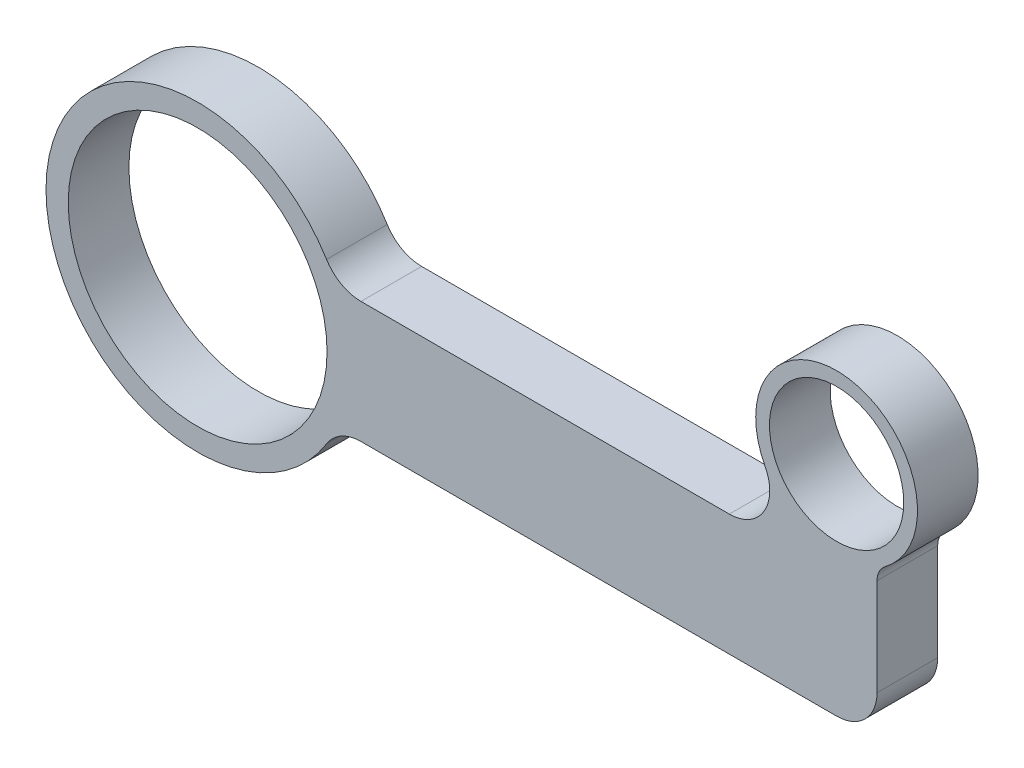
ISO-10303-21;
HEADER;
FILE_DESCRIPTION(('STEP AP214'),'2;1');
FILE_NAME('part.step','',(''),(''),'','','');
FILE_SCHEMA(('AUTOMOTIVE_DESIGN { 1 0 10303 214 1 1 1 1 }'));
ENDSEC;
DATA;
#1=APPLICATION_CONTEXT('core data for automotive mechanical design processes');
#2=APPLICATION_PROTOCOL_DEFINITION('international standard','automotive_design',2000,#1);
#3=PRODUCT_CONTEXT('',#1,'mechanical');
#4=PRODUCT('Part','Part','',(#3));
#5=PRODUCT_RELATED_PRODUCT_CATEGORY('part','',(#4));
#6=PRODUCT_DEFINITION_FORMATION('','',#4);
#7=PRODUCT_DEFINITION_CONTEXT('part definition',#1,'design');
#8=PRODUCT_DEFINITION('design','',#6,#7);
#9=PRODUCT_DEFINITION_SHAPE('','',#8);
#10=(LENGTH_UNIT() NAMED_UNIT(*) SI_UNIT(.MILLI.,.METRE.));
#11=(NAMED_UNIT(*) PLANE_ANGLE_UNIT() SI_UNIT($,.RADIAN.));
#12=(NAMED_UNIT(*) SI_UNIT($,.STERADIAN.) SOLID_ANGLE_UNIT());
#13=UNCERTAINTY_MEASURE_WITH_UNIT(LENGTH_MEASURE(1.E-05),#10,'distance_accuracy_value','');
#14=(GEOMETRIC_REPRESENTATION_CONTEXT(3) GLOBAL_UNCERTAINTY_ASSIGNED_CONTEXT((#13)) GLOBAL_UNIT_ASSIGNED_CONTEXT((#10,
#11,#12)) REPRESENTATION_CONTEXT('',''));
#15=CARTESIAN_POINT('',(0.,0.,0.));
#16=DIRECTION('',(0.,0.,1.));
#17=DIRECTION('',(1.,0.,0.));
#18=AXIS2_PLACEMENT_3D('',#15,#16,#17);
#19=CARTESIAN_POINT('',(119.38,24.13,19.05));
#20=DIRECTION('',(0.,0.,-1.));
#21=DIRECTION('',(-1.,0.,0.));
#22=AXIS2_PLACEMENT_3D('',#19,#20,#21);
#23=PLANE('',#22);
#24=CARTESIAN_POINT('',(119.38,24.13,19.05));
#25=DIRECTION('',(0.,0.,-1.));
#26=DIRECTION('',(-1.,0.,0.));
#27=AXIS2_PLACEMENT_3D('',#24,#25,#26);
#28=CIRCLE('',#27,6.35);
#29=CARTESIAN_POINT('',(113.03,24.13,19.05));
#30=VERTEX_POINT('',#29);
#31=CARTESIAN_POINT('',(115.57,29.21,19.05));
#32=VERTEX_POINT('',#31);
#33=EDGE_CURVE('E162',#30,#32,#28,.T.);
#34=ORIENTED_EDGE('',*,*,#33,.T.);
#35=CARTESIAN_POINT('',(100.33,49.53,19.05));
#36=DIRECTION('',(0.,0.,1.));
#37=DIRECTION('',(1.,0.,0.));
#38=AXIS2_PLACEMENT_3D('',#35,#36,#37);
#39=CIRCLE('',#38,25.4);
#40=CARTESIAN_POINT('',(77.8653947533261,37.6766666666666,19.05));
#41=VERTEX_POINT('',#40);
#42=EDGE_CURVE('E98',#32,#41,#39,.T.);
#43=ORIENTED_EDGE('',*,*,#42,.T.);
#44=CARTESIAN_POINT('',(66.6330921299892,31.75,19.05));
#45=DIRECTION('',(0.,0.,-1.));
#46=DIRECTION('',(1.,0.,0.));
#47=AXIS2_PLACEMENT_3D('',#44,#45,#46);
#48=CIRCLE('',#47,12.7);
#49=CARTESIAN_POINT('',(66.6330921299892,19.05,19.05));
#50=VERTEX_POINT('',#49);
#51=EDGE_CURVE('E183',#41,#50,#48,.T.);
#52=ORIENTED_EDGE('',*,*,#51,.T.);
#53=DIRECTION('',(-1.,0.,0.));
#54=VECTOR('',#53,1.);
#55=CARTESIAN_POINT('',(66.6330921299892,19.05,19.05));
#56=LINE('',#55,#54);
#57=CARTESIAN_POINT('',(-49.0363052120438,19.05,19.05));
#58=VERTEX_POINT('',#57);
#59=EDGE_CURVE('E200',#50,#58,#56,.T.);
#60=ORIENTED_EDGE('',*,*,#59,.T.);
#61=CARTESIAN_POINT('',(-49.0363052120438,31.75,19.05));
#62=DIRECTION('',(0.,0.,-1.));
#63=DIRECTION('',(1.,0.,0.));
#64=AXIS2_PLACEMENT_3D('',#61,#62,#63);
#65=CIRCLE('',#64,12.7);
#66=CARTESIAN_POINT('',(-59.834977798982,25.0657894736842,19.05));
#67=VERTEX_POINT('',#66);
#68=EDGE_CURVE('E197',#58,#67,#65,.T.);
#69=ORIENTED_EDGE('',*,*,#68,.T.);
#70=CARTESIAN_POINT('',(-100.33,0.,19.05));
#71=DIRECTION('',(0.,0.,1.));
#72=DIRECTION('',(1.,0.,0.));
#73=AXIS2_PLACEMENT_3D('',#70,#71,#72);
#74=CIRCLE('',#73,47.625);
#75=CARTESIAN_POINT('',(-59.834977798982,-25.0657894736842,19.05));
#76=VERTEX_POINT('',#75);
#77=EDGE_CURVE('E199',#67,#76,#74,.T.);
#78=ORIENTED_EDGE('',*,*,#77,.T.);
#79=CARTESIAN_POINT('',(-49.0363052120438,-31.75,19.05));
#80=DIRECTION('',(0.,0.,-1.));
#81=DIRECTION('',(-1.,0.,0.));
#82=AXIS2_PLACEMENT_3D('',#79,#80,#81);
#83=CIRCLE('',#82,12.7);
#84=CARTESIAN_POINT('',(-49.0363052120438,-19.05,19.05));
#85=VERTEX_POINT('',#84);
#86=EDGE_CURVE('E123',#76,#85,#83,.T.);
#87=ORIENTED_EDGE('',*,*,#86,.T.);
#88=DIRECTION('',(1.,0.,0.));
#89=VECTOR('',#88,1.);
#90=CARTESIAN_POINT('',(-49.0363052120438,-19.05,19.05));
#91=LINE('',#90,#89);
#92=CARTESIAN_POINT('',(100.33,-19.05,19.05));
#93=VERTEX_POINT('',#92);
#94=EDGE_CURVE('E117',#85,#93,#91,.T.);
#95=ORIENTED_EDGE('',*,*,#94,.T.);
#96=CARTESIAN_POINT('',(100.33,-6.35,19.05));
#97=DIRECTION('',(0.,0.,1.));
#98=DIRECTION('',(1.,0.,0.));
#99=AXIS2_PLACEMENT_3D('',#96,#97,#98);
#100=CIRCLE('',#99,12.7);
#101=CARTESIAN_POINT('',(113.03,-6.35,19.05));
#102=VERTEX_POINT('',#101);
#103=EDGE_CURVE('E121',#93,#102,#100,.T.);
#104=ORIENTED_EDGE('',*,*,#103,.T.);
#105=DIRECTION('',(0.,1.,0.));
#106=VECTOR('',#105,1.);
#107=CARTESIAN_POINT('',(113.03,-6.35,19.05));
#108=LINE('',#107,#106);
#109=EDGE_CURVE('E49',#102,#30,#108,.T.);
#110=ORIENTED_EDGE('',*,*,#109,.T.);
#111=EDGE_LOOP('',(#34,#43,#52,#60,#69,#78,#87,#95,#104,#110));
#112=FACE_BOUND('',#111,.T.);
#113=CARTESIAN_POINT('',(-100.33,0.,19.05));
#114=DIRECTION('',(0.,0.,1.));
#115=DIRECTION('',(1.,0.,0.));
#116=AXIS2_PLACEMENT_3D('',#113,#114,#115);
#117=CIRCLE('',#116,40.64);
#118=CARTESIAN_POINT('',(-59.69,0.,19.05));
#119=VERTEX_POINT('',#118);
#120=EDGE_CURVE('E144',#119,#119,#117,.T.);
#121=ORIENTED_EDGE('',*,*,#120,.F.);
#122=EDGE_LOOP('',(#121));
#123=FACE_BOUND('',#122,.T.);
#124=CARTESIAN_POINT('',(100.33,49.53,19.05));
#125=DIRECTION('',(0.,0.,1.));
#126=DIRECTION('',(1.,0.,0.));
#127=AXIS2_PLACEMENT_3D('',#124,#125,#126);
#128=CIRCLE('',#127,21.0820000000001);
#129=CARTESIAN_POINT('',(121.412,49.53,19.05));
#130=VERTEX_POINT('',#129);
#131=EDGE_CURVE('E211',#130,#130,#128,.T.);
#132=ORIENTED_EDGE('',*,*,#131,.F.);
#133=EDGE_LOOP('',(#132));
#134=FACE_BOUND('',#133,.T.);
#135=ADVANCED_FACE('F32',(#112,#123,#134),#23,.F.);
#136=CARTESIAN_POINT('',(119.38,24.13,0.));
#137=DIRECTION('',(0.,0.,-1.));
#138=DIRECTION('',(-1.,0.,0.));
#139=AXIS2_PLACEMENT_3D('',#136,#137,#138);
#140=PLANE('',#139);
#141=CARTESIAN_POINT('',(-100.33,0.,0.));
#142=DIRECTION('',(0.,0.,1.));
#143=DIRECTION('',(1.,0.,0.));
#144=AXIS2_PLACEMENT_3D('',#141,#142,#143);
#145=CIRCLE('',#144,40.64);
#146=CARTESIAN_POINT('',(-59.69,0.,0.));
#147=VERTEX_POINT('',#146);
#148=EDGE_CURVE('E208',#147,#147,#145,.T.);
#149=ORIENTED_EDGE('',*,*,#148,.T.);
#150=EDGE_LOOP('',(#149));
#151=FACE_BOUND('',#150,.T.);
#152=CARTESIAN_POINT('',(119.38,24.13,0.));
#153=DIRECTION('',(0.,0.,-1.));
#154=DIRECTION('',(-1.,0.,0.));
#155=AXIS2_PLACEMENT_3D('',#152,#153,#154);
#156=CIRCLE('',#155,6.35);
#157=CARTESIAN_POINT('',(113.03,24.13,0.));
#158=VERTEX_POINT('',#157);
#159=CARTESIAN_POINT('',(115.57,29.21,0.));
#160=VERTEX_POINT('',#159);
#161=EDGE_CURVE('E140',#158,#160,#156,.T.);
#162=ORIENTED_EDGE('',*,*,#161,.F.);
#163=DIRECTION('',(0.,1.,0.));
#164=VECTOR('',#163,1.);
#165=CARTESIAN_POINT('',(113.03,-6.35,0.));
#166=LINE('',#165,#164);
#167=CARTESIAN_POINT('',(113.03,-6.35,0.));
#168=VERTEX_POINT('',#167);
#169=EDGE_CURVE('E90',#168,#158,#166,.T.);
#170=ORIENTED_EDGE('',*,*,#169,.F.);
#171=CARTESIAN_POINT('',(100.33,-6.35,0.));
#172=DIRECTION('',(0.,0.,1.));
#173=DIRECTION('',(1.,0.,0.));
#174=AXIS2_PLACEMENT_3D('',#171,#172,#173);
#175=CIRCLE('',#174,12.7);
#176=CARTESIAN_POINT('',(100.33,-19.05,0.));
#177=VERTEX_POINT('',#176);
#178=EDGE_CURVE('E84',#177,#168,#175,.T.);
#179=ORIENTED_EDGE('',*,*,#178,.F.);
#180=DIRECTION('',(1.,0.,0.));
#181=VECTOR('',#180,1.);
#182=CARTESIAN_POINT('',(12.7,-19.05,0.));
#183=LINE('',#182,#181);
#184=CARTESIAN_POINT('',(-49.0363052120438,-19.05,0.));
#185=VERTEX_POINT('',#184);
#186=EDGE_CURVE('E130',#185,#177,#183,.T.);
#187=ORIENTED_EDGE('',*,*,#186,.F.);
#188=CARTESIAN_POINT('',(-49.0363052120438,-31.75,0.));
#189=DIRECTION('',(0.,0.,-1.));
#190=DIRECTION('',(-1.,0.,0.));
#191=AXIS2_PLACEMENT_3D('',#188,#189,#190);
#192=CIRCLE('',#191,12.7);
#193=CARTESIAN_POINT('',(-59.834977798982,-25.0657894736842,0.));
#194=VERTEX_POINT('',#193);
#195=EDGE_CURVE('E156',#194,#185,#192,.T.);
#196=ORIENTED_EDGE('',*,*,#195,.F.);
#197=CARTESIAN_POINT('',(-100.33,0.,0.));
#198=DIRECTION('',(0.,0.,1.));
#199=DIRECTION('',(1.,0.,0.));
#200=AXIS2_PLACEMENT_3D('',#197,#198,#199);
#201=CIRCLE('',#200,47.625);
#202=CARTESIAN_POINT('',(-59.834977798982,25.0657894736842,0.));
#203=VERTEX_POINT('',#202);
#204=EDGE_CURVE('E154',#203,#194,#201,.T.);
#205=ORIENTED_EDGE('',*,*,#204,.F.);
#206=CARTESIAN_POINT('',(-49.0363052120438,31.75,0.));
#207=DIRECTION('',(0.,0.,-1.));
#208=DIRECTION('',(1.,0.,0.));
#209=AXIS2_PLACEMENT_3D('',#206,#207,#208);
#210=CIRCLE('',#209,12.7);
#211=CARTESIAN_POINT('',(-49.0363052120438,19.05,0.));
#212=VERTEX_POINT('',#211);
#213=EDGE_CURVE('E151',#212,#203,#210,.T.);
#214=ORIENTED_EDGE('',*,*,#213,.F.);
#215=DIRECTION('',(-1.,0.,0.));
#216=VECTOR('',#215,1.);
#217=CARTESIAN_POINT('',(-49.0363052120438,19.05,0.));
#218=LINE('',#217,#216);
#219=CARTESIAN_POINT('',(66.6330921299892,19.05,0.));
#220=VERTEX_POINT('',#219);
#221=EDGE_CURVE('E149',#220,#212,#218,.T.);
#222=ORIENTED_EDGE('',*,*,#221,.F.);
#223=CARTESIAN_POINT('',(66.6330921299892,31.75,0.));
#224=DIRECTION('',(0.,0.,-1.));
#225=DIRECTION('',(1.,0.,0.));
#226=AXIS2_PLACEMENT_3D('',#223,#224,#225);
#227=CIRCLE('',#226,12.7);
#228=CARTESIAN_POINT('',(77.8653947533261,37.6766666666666,0.));
#229=VERTEX_POINT('',#228);
#230=EDGE_CURVE('E146',#229,#220,#227,.T.);
#231=ORIENTED_EDGE('',*,*,#230,.F.);
#232=CARTESIAN_POINT('',(100.33,49.53,0.));
#233=DIRECTION('',(0.,0.,1.));
#234=DIRECTION('',(1.,0.,0.));
#235=AXIS2_PLACEMENT_3D('',#232,#233,#234);
#236=CIRCLE('',#235,25.4);
#237=EDGE_CURVE('E143',#160,#229,#236,.T.);
#238=ORIENTED_EDGE('',*,*,#237,.F.);
#239=EDGE_LOOP('',(#162,#170,#179,#187,#196,#205,#214,#222,#231,#238));
#240=FACE_BOUND('',#239,.T.);
#241=CARTESIAN_POINT('',(100.33,49.53,0.));
#242=DIRECTION('',(0.,0.,1.));
#243=DIRECTION('',(1.,0.,0.));
#244=AXIS2_PLACEMENT_3D('',#241,#242,#243);
#245=CIRCLE('',#244,21.0820000000001);
#246=CARTESIAN_POINT('',(121.412,49.53,0.));
#247=VERTEX_POINT('',#246);
#248=EDGE_CURVE('E214',#247,#247,#245,.T.);
#249=ORIENTED_EDGE('',*,*,#248,.T.);
#250=EDGE_LOOP('',(#249));
#251=FACE_BOUND('',#250,.T.);
#252=ADVANCED_FACE('F186',(#151,#240,#251),#140,.T.);
#253=CARTESIAN_POINT('',(119.38,24.13,19.05));
#254=DIRECTION('',(0.,0.,-1.));
#255=DIRECTION('',(-1.,0.,0.));
#256=AXIS2_PLACEMENT_3D('',#253,#254,#255);
#257=CYLINDRICAL_SURFACE('',#256,6.35);
#258=ORIENTED_EDGE('',*,*,#161,.T.);
#259=DIRECTION('',(0.,0.,-1.));
#260=VECTOR('',#259,1.);
#261=CARTESIAN_POINT('',(115.57,29.21,19.05));
#262=LINE('',#261,#260);
#263=EDGE_CURVE('E11',#32,#160,#262,.T.);
#264=ORIENTED_EDGE('',*,*,#263,.F.);
#265=ORIENTED_EDGE('',*,*,#33,.F.);
#266=DIRECTION('',(0.,0.,-1.));
#267=VECTOR('',#266,1.);
#268=CARTESIAN_POINT('',(113.03,24.13,19.05));
#269=LINE('',#268,#267);
#270=EDGE_CURVE('E136',#30,#158,#269,.T.);
#271=ORIENTED_EDGE('',*,*,#270,.T.);
#272=EDGE_LOOP('',(#258,#264,#265,#271));
#273=FACE_BOUND('',#272,.T.);
#274=ADVANCED_FACE('F34',(#273),#257,.F.);
#275=CARTESIAN_POINT('',(100.33,49.53,19.05));
#276=DIRECTION('',(0.,0.,-1.));
#277=DIRECTION('',(-1.,0.,0.));
#278=AXIS2_PLACEMENT_3D('',#275,#276,#277);
#279=CYLINDRICAL_SURFACE('',#278,25.4);
#280=ORIENTED_EDGE('',*,*,#237,.T.);
#281=DIRECTION('',(0.,0.,-1.));
#282=VECTOR('',#281,1.);
#283=CARTESIAN_POINT('',(77.8653947533261,37.6766666666666,19.05));
#284=LINE('',#283,#282);
#285=EDGE_CURVE('E41',#41,#229,#284,.T.);
#286=ORIENTED_EDGE('',*,*,#285,.F.);
#287=ORIENTED_EDGE('',*,*,#42,.F.);
#288=ORIENTED_EDGE('',*,*,#263,.T.);
#289=EDGE_LOOP('',(#280,#286,#287,#288));
#290=FACE_BOUND('',#289,.T.);
#291=ADVANCED_FACE('F254',(#290),#279,.T.);
#292=CARTESIAN_POINT('',(66.6330921299892,31.75,19.05));
#293=DIRECTION('',(0.,0.,-1.));
#294=DIRECTION('',(-1.,0.,0.));
#295=AXIS2_PLACEMENT_3D('',#292,#293,#294);
#296=CYLINDRICAL_SURFACE('',#295,12.7);
#297=ORIENTED_EDGE('',*,*,#230,.T.);
#298=DIRECTION('',(0.,0.,-1.));
#299=VECTOR('',#298,1.);
#300=CARTESIAN_POINT('',(66.6330921299892,19.05,19.05));
#301=LINE('',#300,#299);
#302=EDGE_CURVE('E175',#50,#220,#301,.T.);
#303=ORIENTED_EDGE('',*,*,#302,.F.);
#304=ORIENTED_EDGE('',*,*,#51,.F.);
#305=ORIENTED_EDGE('',*,*,#285,.T.);
#306=EDGE_LOOP('',(#297,#303,#304,#305));
#307=FACE_BOUND('',#306,.T.);
#308=ADVANCED_FACE('F181',(#307),#296,.F.);
#309=CARTESIAN_POINT('',(-49.0363052120438,19.05,19.05));
#310=DIRECTION('',(0.,-1.,0.));
#311=DIRECTION('',(1.,0.,0.));
#312=AXIS2_PLACEMENT_3D('',#309,#310,#311);
#313=PLANE('',#312);
#314=ORIENTED_EDGE('',*,*,#221,.T.);
#315=DIRECTION('',(0.,0.,-1.));
#316=VECTOR('',#315,1.);
#317=CARTESIAN_POINT('',(-49.0363052120438,19.05,19.05));
#318=LINE('',#317,#316);
#319=EDGE_CURVE('E172',#58,#212,#318,.T.);
#320=ORIENTED_EDGE('',*,*,#319,.F.);
#321=ORIENTED_EDGE('',*,*,#59,.F.);
#322=ORIENTED_EDGE('',*,*,#302,.T.);
#323=EDGE_LOOP('',(#314,#320,#321,#322));
#324=FACE_BOUND('',#323,.T.);
#325=ADVANCED_FACE('F191',(#324),#313,.F.);
#326=CARTESIAN_POINT('',(-49.0363052120438,31.75,19.05));
#327=DIRECTION('',(0.,0.,-1.));
#328=DIRECTION('',(-1.,0.,0.));
#329=AXIS2_PLACEMENT_3D('',#326,#327,#328);
#330=CYLINDRICAL_SURFACE('',#329,12.7);
#331=ORIENTED_EDGE('',*,*,#213,.T.);
#332=DIRECTION('',(0.,0.,-1.));
#333=VECTOR('',#332,1.);
#334=CARTESIAN_POINT('',(-59.834977798982,25.0657894736842,19.05));
#335=LINE('',#334,#333);
#336=EDGE_CURVE('E169',#67,#203,#335,.T.);
#337=ORIENTED_EDGE('',*,*,#336,.F.);
#338=ORIENTED_EDGE('',*,*,#68,.F.);
#339=ORIENTED_EDGE('',*,*,#319,.T.);
#340=EDGE_LOOP('',(#331,#337,#338,#339));
#341=FACE_BOUND('',#340,.T.);
#342=ADVANCED_FACE('F195',(#341),#330,.F.);
#343=CARTESIAN_POINT('',(-100.33,0.,19.05));
#344=DIRECTION('',(0.,0.,-1.));
#345=DIRECTION('',(-1.,0.,0.));
#346=AXIS2_PLACEMENT_3D('',#343,#344,#345);
#347=CYLINDRICAL_SURFACE('',#346,47.625);
#348=ORIENTED_EDGE('',*,*,#204,.T.);
#349=DIRECTION('',(0.,0.,-1.));
#350=VECTOR('',#349,1.);
#351=CARTESIAN_POINT('',(-59.834977798982,-25.0657894736842,19.05));
#352=LINE('',#351,#350);
#353=EDGE_CURVE('E166',#76,#194,#352,.T.);
#354=ORIENTED_EDGE('',*,*,#353,.F.);
#355=ORIENTED_EDGE('',*,*,#77,.F.);
#356=ORIENTED_EDGE('',*,*,#336,.T.);
#357=EDGE_LOOP('',(#348,#354,#355,#356));
#358=FACE_BOUND('',#357,.T.);
#359=ADVANCED_FACE('F244',(#358),#347,.T.);
#360=CARTESIAN_POINT('',(-49.0363052120438,-31.75,19.05));
#361=DIRECTION('',(0.,0.,-1.));
#362=DIRECTION('',(-1.,0.,0.));
#363=AXIS2_PLACEMENT_3D('',#360,#361,#362);
#364=CYLINDRICAL_SURFACE('',#363,12.7);
#365=ORIENTED_EDGE('',*,*,#195,.T.);
#366=DIRECTION('',(0.,0.,-1.));
#367=VECTOR('',#366,1.);
#368=CARTESIAN_POINT('',(-49.0363052120438,-19.05,19.05));
#369=LINE('',#368,#367);
#370=EDGE_CURVE('E131',#85,#185,#369,.T.);
#371=ORIENTED_EDGE('',*,*,#370,.F.);
#372=ORIENTED_EDGE('',*,*,#86,.F.);
#373=ORIENTED_EDGE('',*,*,#353,.T.);
#374=EDGE_LOOP('',(#365,#371,#372,#373));
#375=FACE_BOUND('',#374,.T.);
#376=ADVANCED_FACE('F241',(#375),#364,.F.);
#377=CARTESIAN_POINT('',(12.7,-19.05,19.05));
#378=DIRECTION('',(0.,1.,0.));
#379=DIRECTION('',(-1.,0.,0.));
#380=AXIS2_PLACEMENT_3D('',#377,#378,#379);
#381=PLANE('',#380);
#382=ORIENTED_EDGE('',*,*,#186,.T.);
#383=DIRECTION('',(0.,0.,-1.));
#384=VECTOR('',#383,1.);
#385=CARTESIAN_POINT('',(100.33,-19.05,19.05));
#386=LINE('',#385,#384);
#387=EDGE_CURVE('E128',#93,#177,#386,.T.);
#388=ORIENTED_EDGE('',*,*,#387,.F.);
#389=ORIENTED_EDGE('',*,*,#94,.F.);
#390=ORIENTED_EDGE('',*,*,#370,.T.);
#391=EDGE_LOOP('',(#382,#388,#389,#390));
#392=FACE_BOUND('',#391,.T.);
#393=ADVANCED_FACE('F129',(#392),#381,.F.);
#394=CARTESIAN_POINT('',(100.33,-6.35,19.05));
#395=DIRECTION('',(0.,0.,-1.));
#396=DIRECTION('',(-1.,0.,0.));
#397=AXIS2_PLACEMENT_3D('',#394,#395,#396);
#398=CYLINDRICAL_SURFACE('',#397,12.7);
#399=ORIENTED_EDGE('',*,*,#178,.T.);
#400=DIRECTION('',(0.,0.,-1.));
#401=VECTOR('',#400,1.);
#402=CARTESIAN_POINT('',(113.03,-6.35,19.05));
#403=LINE('',#402,#401);
#404=EDGE_CURVE('E132',#102,#168,#403,.T.);
#405=ORIENTED_EDGE('',*,*,#404,.F.);
#406=ORIENTED_EDGE('',*,*,#103,.F.);
#407=ORIENTED_EDGE('',*,*,#387,.T.);
#408=EDGE_LOOP('',(#399,#405,#406,#407));
#409=FACE_BOUND('',#408,.T.);
#410=ADVANCED_FACE('F134',(#409),#398,.T.);
#411=CARTESIAN_POINT('',(113.03,-6.35,19.05));
#412=DIRECTION('',(-1.,0.,0.));
#413=DIRECTION('',(0.,-1.,0.));
#414=AXIS2_PLACEMENT_3D('',#411,#412,#413);
#415=PLANE('',#414);
#416=ORIENTED_EDGE('',*,*,#169,.T.);
#417=ORIENTED_EDGE('',*,*,#270,.F.);
#418=ORIENTED_EDGE('',*,*,#109,.F.);
#419=ORIENTED_EDGE('',*,*,#404,.T.);
#420=EDGE_LOOP('',(#416,#417,#418,#419));
#421=FACE_BOUND('',#420,.T.);
#422=ADVANCED_FACE('F234',(#421),#415,.F.);
#423=CARTESIAN_POINT('',(-100.33,0.,19.05));
#424=DIRECTION('',(0.,0.,-1.));
#425=DIRECTION('',(-1.,0.,0.));
#426=AXIS2_PLACEMENT_3D('',#423,#424,#425);
#427=CYLINDRICAL_SURFACE('',#426,40.64);
#428=ORIENTED_EDGE('',*,*,#120,.T.);
#429=EDGE_LOOP('',(#428));
#430=FACE_BOUND('',#429,.T.);
#431=ORIENTED_EDGE('',*,*,#148,.F.);
#432=EDGE_LOOP('',(#431));
#433=FACE_BOUND('',#432,.T.);
#434=ADVANCED_FACE('F231',(#430,#433),#427,.F.);
#435=CARTESIAN_POINT('',(100.33,49.53,19.05));
#436=DIRECTION('',(0.,0.,-1.));
#437=DIRECTION('',(-1.,0.,0.));
#438=AXIS2_PLACEMENT_3D('',#435,#436,#437);
#439=CYLINDRICAL_SURFACE('',#438,21.0820000000001);
#440=ORIENTED_EDGE('',*,*,#131,.T.);
#441=EDGE_LOOP('',(#440));
#442=FACE_BOUND('',#441,.T.);
#443=ORIENTED_EDGE('',*,*,#248,.F.);
#444=EDGE_LOOP('',(#443));
#445=FACE_BOUND('',#444,.T.);
#446=ADVANCED_FACE('F220',(#442,#445),#439,.F.);
#447=CLOSED_SHELL('',(#135,#252,#274,#291,#308,#325,#342,#359,#376,#393,#410,#422,#434,#446));
#448=MANIFOLD_SOLID_BREP('B2',#447);
#449=ADVANCED_BREP_SHAPE_REPRESENTATION('',(#18,#448),#14);
#450=SHAPE_DEFINITION_REPRESENTATION(#9,#449);
ENDSEC;
END-ISO-10303-21;
